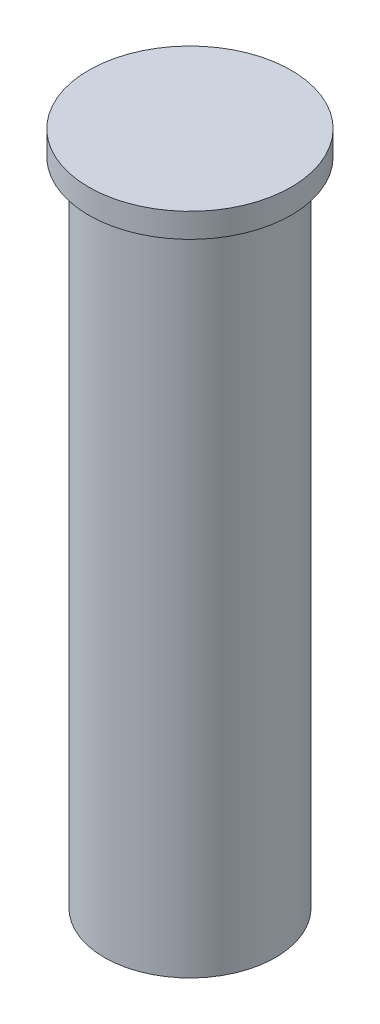
ISO-10303-21;
HEADER;
FILE_DESCRIPTION(('STEP AP214'),'2;1');
FILE_NAME('part.step','',(''),(''),'','','');
FILE_SCHEMA(('AUTOMOTIVE_DESIGN { 1 0 10303 214 1 1 1 1 }'));
ENDSEC;
DATA;
#1=APPLICATION_CONTEXT('core data for automotive mechanical design processes');
#2=APPLICATION_PROTOCOL_DEFINITION('international standard','automotive_design',2000,#1);
#3=PRODUCT_CONTEXT('',#1,'mechanical');
#4=PRODUCT('Part','Part','',(#3));
#5=PRODUCT_RELATED_PRODUCT_CATEGORY('part','',(#4));
#6=PRODUCT_DEFINITION_FORMATION('','',#4);
#7=PRODUCT_DEFINITION_CONTEXT('part definition',#1,'design');
#8=PRODUCT_DEFINITION('design','',#6,#7);
#9=PRODUCT_DEFINITION_SHAPE('','',#8);
#10=(LENGTH_UNIT() NAMED_UNIT(*) SI_UNIT(.MILLI.,.METRE.));
#11=(NAMED_UNIT(*) PLANE_ANGLE_UNIT() SI_UNIT($,.RADIAN.));
#12=(NAMED_UNIT(*) SI_UNIT($,.STERADIAN.) SOLID_ANGLE_UNIT());
#13=UNCERTAINTY_MEASURE_WITH_UNIT(LENGTH_MEASURE(1.E-05),#10,'distance_accuracy_value','');
#14=(GEOMETRIC_REPRESENTATION_CONTEXT(3) GLOBAL_UNCERTAINTY_ASSIGNED_CONTEXT((#13)) GLOBAL_UNIT_ASSIGNED_CONTEXT((#10,
#11,#12)) REPRESENTATION_CONTEXT('',''));
#15=CARTESIAN_POINT('',(0.,0.,0.));
#16=DIRECTION('',(0.,0.,1.));
#17=DIRECTION('',(1.,0.,0.));
#18=AXIS2_PLACEMENT_3D('',#15,#16,#17);
#19=CARTESIAN_POINT('',(0.,1.143,0.));
#20=DIRECTION('',(0.,-1.,0.));
#21=DIRECTION('',(0.,0.,-1.));
#22=AXIS2_PLACEMENT_3D('',#19,#20,#21);
#23=CYLINDRICAL_SURFACE('',#22,4.7625);
#24=CARTESIAN_POINT('',(0.,1.143,0.));
#25=DIRECTION('',(0.,1.,0.));
#26=DIRECTION('',(0.,0.,1.));
#27=AXIS2_PLACEMENT_3D('',#24,#25,#26);
#28=CIRCLE('',#27,4.7625);
#29=CARTESIAN_POINT('',(0.,1.143,4.7625));
#30=VERTEX_POINT('',#29);
#31=EDGE_CURVE('E11',#30,#30,#28,.T.);
#32=ORIENTED_EDGE('',*,*,#31,.F.);
#33=EDGE_LOOP('',(#32));
#34=FACE_BOUND('',#33,.T.);
#35=CARTESIAN_POINT('',(0.,0.,0.));
#36=DIRECTION('',(0.,1.,0.));
#37=DIRECTION('',(0.,0.,1.));
#38=AXIS2_PLACEMENT_3D('',#35,#36,#37);
#39=CIRCLE('',#38,4.7625);
#40=CARTESIAN_POINT('',(0.,0.,4.7625));
#41=VERTEX_POINT('',#40);
#42=EDGE_CURVE('E47',#41,#41,#39,.T.);
#43=ORIENTED_EDGE('',*,*,#42,.T.);
#44=EDGE_LOOP('',(#43));
#45=FACE_BOUND('',#44,.T.);
#46=ADVANCED_FACE('F40',(#34,#45),#23,.T.);
#47=CARTESIAN_POINT('',(0.,1.143,0.));
#48=DIRECTION('',(0.,1.,0.));
#49=DIRECTION('',(0.,0.,1.));
#50=AXIS2_PLACEMENT_3D('',#47,#48,#49);
#51=PLANE('',#50);
#52=ORIENTED_EDGE('',*,*,#31,.T.);
#53=EDGE_LOOP('',(#52));
#54=FACE_BOUND('',#53,.T.);
#55=ADVANCED_FACE('F89',(#54),#51,.T.);
#56=CARTESIAN_POINT('',(0.,0.,0.));
#57=DIRECTION('',(0.,1.,0.));
#58=DIRECTION('',(0.,0.,1.));
#59=AXIS2_PLACEMENT_3D('',#56,#57,#58);
#60=PLANE('',#59);
#61=CARTESIAN_POINT('',(0.,0.,0.));
#62=DIRECTION('',(0.,1.,0.));
#63=DIRECTION('',(0.,0.,1.));
#64=AXIS2_PLACEMENT_3D('',#61,#62,#63);
#65=CIRCLE('',#64,4.0259);
#66=CARTESIAN_POINT('',(0.,0.,4.0259));
#67=VERTEX_POINT('',#66);
#68=EDGE_CURVE('E43',#67,#67,#65,.T.);
#69=ORIENTED_EDGE('',*,*,#68,.T.);
#70=EDGE_LOOP('',(#69));
#71=FACE_BOUND('',#70,.T.);
#72=ORIENTED_EDGE('',*,*,#42,.F.);
#73=EDGE_LOOP('',(#72));
#74=FACE_BOUND('',#73,.T.);
#75=ADVANCED_FACE('F76',(#71,#74),#60,.F.);
#76=CARTESIAN_POINT('',(0.,-30.607,0.));
#77=DIRECTION('',(0.,1.,0.));
#78=DIRECTION('',(0.,0.,1.));
#79=AXIS2_PLACEMENT_3D('',#76,#77,#78);
#80=CYLINDRICAL_SURFACE('',#79,4.0259);
#81=CARTESIAN_POINT('',(0.,-30.607,0.));
#82=DIRECTION('',(0.,1.,0.));
#83=DIRECTION('',(0.,0.,1.));
#84=AXIS2_PLACEMENT_3D('',#81,#82,#83);
#85=CIRCLE('',#84,4.0259);
#86=CARTESIAN_POINT('',(0.,-30.607,4.0259));
#87=VERTEX_POINT('',#86);
#88=EDGE_CURVE('E61',#87,#87,#85,.T.);
#89=ORIENTED_EDGE('',*,*,#88,.T.);
#90=EDGE_LOOP('',(#89));
#91=FACE_BOUND('',#90,.T.);
#92=ORIENTED_EDGE('',*,*,#68,.F.);
#93=EDGE_LOOP('',(#92));
#94=FACE_BOUND('',#93,.T.);
#95=ADVANCED_FACE('F79',(#91,#94),#80,.T.);
#96=CARTESIAN_POINT('',(0.,-30.607,0.));
#97=DIRECTION('',(0.,1.,0.));
#98=DIRECTION('',(0.,0.,1.));
#99=AXIS2_PLACEMENT_3D('',#96,#97,#98);
#100=PLANE('',#99);
#101=CARTESIAN_POINT('',(0.,-30.607,0.));
#102=DIRECTION('',(0.,-1.,0.));
#103=DIRECTION('',(0.,0.,-1.));
#104=AXIS2_PLACEMENT_3D('',#101,#102,#103);
#105=CIRCLE('',#104,2.7178);
#106=CARTESIAN_POINT('',(0.,-30.607,-2.7178));
#107=VERTEX_POINT('',#106);
#108=EDGE_CURVE('E67',#107,#107,#105,.T.);
#109=ORIENTED_EDGE('',*,*,#108,.F.);
#110=EDGE_LOOP('',(#109));
#111=FACE_BOUND('',#110,.T.);
#112=ORIENTED_EDGE('',*,*,#88,.F.);
#113=EDGE_LOOP('',(#112));
#114=FACE_BOUND('',#113,.T.);
#115=ADVANCED_FACE('F55',(#111,#114),#100,.F.);
#116=CARTESIAN_POINT('',(0.,-11.557,0.));
#117=DIRECTION('',(0.,-1.,0.));
#118=DIRECTION('',(0.,0.,-1.));
#119=AXIS2_PLACEMENT_3D('',#116,#117,#118);
#120=CONICAL_SURFACE('',#119,1.7272,1.02974425867665);
#121=CARTESIAN_POINT('',(0.,-10.5191935388156,0.));
#122=VERTEX_POINT('',#121);
#123=VERTEX_LOOP('',#122);
#124=FACE_BOUND('',#123,.T.);
#125=CARTESIAN_POINT('',(0.,-11.557,0.));
#126=DIRECTION('',(0.,-1.,0.));
#127=DIRECTION('',(0.,0.,-1.));
#128=AXIS2_PLACEMENT_3D('',#125,#126,#127);
#129=CIRCLE('',#128,1.7272);
#130=CARTESIAN_POINT('',(0.,-11.557,-1.7272));
#131=VERTEX_POINT('',#130);
#132=EDGE_CURVE('E59',#131,#131,#129,.T.);
#133=ORIENTED_EDGE('',*,*,#132,.T.);
#134=EDGE_LOOP('',(#133));
#135=FACE_BOUND('',#134,.T.);
#136=ADVANCED_FACE('F51',(#124,#135),#120,.F.);
#137=CARTESIAN_POINT('',(0.,-30.607,0.));
#138=DIRECTION('',(0.,-1.,0.));
#139=DIRECTION('',(0.,0.,-1.));
#140=AXIS2_PLACEMENT_3D('',#137,#138,#139);
#141=CYLINDRICAL_SURFACE('',#140,1.7272);
#142=ORIENTED_EDGE('',*,*,#132,.F.);
#143=EDGE_LOOP('',(#142));
#144=FACE_BOUND('',#143,.T.);
#145=CARTESIAN_POINT('',(0.,-28.2154800451132,0.));
#146=DIRECTION('',(0.,-1.,0.));
#147=DIRECTION('',(0.,0.,-1.));
#148=AXIS2_PLACEMENT_3D('',#145,#146,#147);
#149=CIRCLE('',#148,1.7272);
#150=CARTESIAN_POINT('',(0.,-28.2154800451132,-1.7272));
#151=VERTEX_POINT('',#150);
#152=EDGE_CURVE('E62',#151,#151,#149,.T.);
#153=ORIENTED_EDGE('',*,*,#152,.T.);
#154=EDGE_LOOP('',(#153));
#155=FACE_BOUND('',#154,.T.);
#156=ADVANCED_FACE('F54',(#144,#155),#141,.F.);
#157=CARTESIAN_POINT('',(0.,-30.607,0.));
#158=DIRECTION('',(0.,-1.,0.));
#159=DIRECTION('',(0.,0.,-1.));
#160=AXIS2_PLACEMENT_3D('',#157,#158,#159);
#161=CONICAL_SURFACE('',#160,2.7178,0.392699081698724);
#162=ORIENTED_EDGE('',*,*,#152,.F.);
#163=EDGE_LOOP('',(#162));
#164=FACE_BOUND('',#163,.T.);
#165=ORIENTED_EDGE('',*,*,#108,.T.);
#166=EDGE_LOOP('',(#165));
#167=FACE_BOUND('',#166,.T.);
#168=ADVANCED_FACE('F130',(#164,#167),#161,.F.);
#169=CLOSED_SHELL('',(#46,#55,#75,#95,#115,#136,#156,#168));
#170=MANIFOLD_SOLID_BREP('B2',#169);
#171=ADVANCED_BREP_SHAPE_REPRESENTATION('',(#18,#170),#14);
#172=SHAPE_DEFINITION_REPRESENTATION(#9,#171);
ENDSEC;
END-ISO-10303-21;
